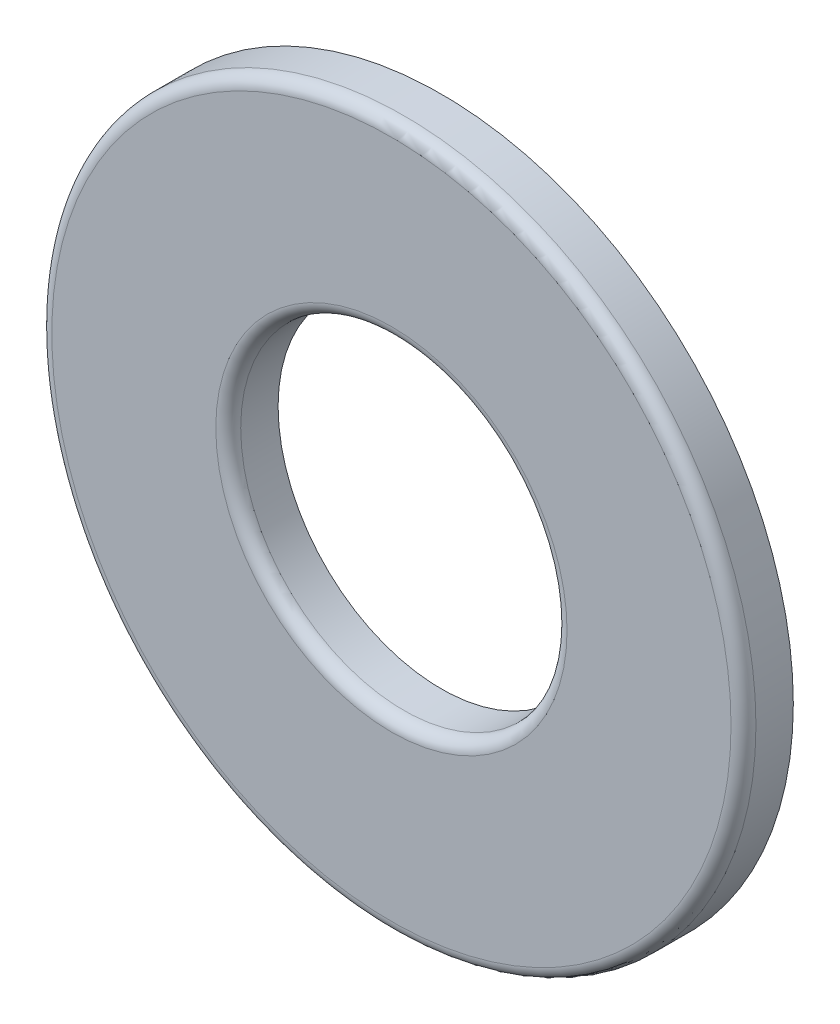
ISO-10303-21;
HEADER;
FILE_DESCRIPTION(('STEP AP214'),'2;1');
FILE_NAME('part.step','',(''),(''),'','','');
FILE_SCHEMA(('AUTOMOTIVE_DESIGN { 1 0 10303 214 1 1 1 1 }'));
ENDSEC;
DATA;
#1=APPLICATION_CONTEXT('core data for automotive mechanical design processes');
#2=APPLICATION_PROTOCOL_DEFINITION('international standard','automotive_design',2000,#1);
#3=PRODUCT_CONTEXT('',#1,'mechanical');
#4=PRODUCT('Part','Part','',(#3));
#5=PRODUCT_RELATED_PRODUCT_CATEGORY('part','',(#4));
#6=PRODUCT_DEFINITION_FORMATION('','',#4);
#7=PRODUCT_DEFINITION_CONTEXT('part definition',#1,'design');
#8=PRODUCT_DEFINITION('design','',#6,#7);
#9=PRODUCT_DEFINITION_SHAPE('','',#8);
#10=(LENGTH_UNIT() NAMED_UNIT(*) SI_UNIT(.MILLI.,.METRE.));
#11=(NAMED_UNIT(*) PLANE_ANGLE_UNIT() SI_UNIT($,.RADIAN.));
#12=(NAMED_UNIT(*) SI_UNIT($,.STERADIAN.) SOLID_ANGLE_UNIT());
#13=UNCERTAINTY_MEASURE_WITH_UNIT(LENGTH_MEASURE(1.E-05),#10,'distance_accuracy_value','');
#14=(GEOMETRIC_REPRESENTATION_CONTEXT(3) GLOBAL_UNCERTAINTY_ASSIGNED_CONTEXT((#13)) GLOBAL_UNIT_ASSIGNED_CONTEXT((#10,
#11,#12)) REPRESENTATION_CONTEXT('',''));
#15=CARTESIAN_POINT('',(0.,0.,0.));
#16=DIRECTION('',(0.,0.,1.));
#17=DIRECTION('',(1.,0.,0.));
#18=AXIS2_PLACEMENT_3D('',#15,#16,#17);
#19=CARTESIAN_POINT('',(0.,0.,0.393699999999996));
#20=DIRECTION('',(0.,0.,1.));
#21=DIRECTION('',(1.,0.,0.));
#22=AXIS2_PLACEMENT_3D('',#19,#20,#21);
#23=PLANE('',#22);
#24=CARTESIAN_POINT('',(0.,0.,0.393699999999996));
#25=DIRECTION('',(0.,0.,1.));
#26=DIRECTION('',(1.,0.,0.));
#27=AXIS2_PLACEMENT_3D('',#24,#25,#26);
#28=CIRCLE('',#27,5.36575);
#29=CARTESIAN_POINT('',(5.36575,0.,0.393699999999996));
#30=VERTEX_POINT('',#29);
#31=EDGE_CURVE('E46',#30,#30,#28,.T.);
#32=ORIENTED_EDGE('',*,*,#31,.T.);
#33=EDGE_LOOP('',(#32));
#34=FACE_BOUND('',#33,.T.);
#35=CARTESIAN_POINT('',(0.,0.,0.393699999999996));
#36=DIRECTION('',(0.,0.,1.));
#37=DIRECTION('',(1.,0.,0.));
#38=AXIS2_PLACEMENT_3D('',#35,#36,#37);
#39=CIRCLE('',#38,2.77495);
#40=CARTESIAN_POINT('',(2.77495,0.,0.393699999999996));
#41=VERTEX_POINT('',#40);
#42=EDGE_CURVE('E50',#41,#41,#39,.F.);
#43=ORIENTED_EDGE('',*,*,#42,.T.);
#44=EDGE_LOOP('',(#43));
#45=FACE_BOUND('',#44,.T.);
#46=ADVANCED_FACE('F35',(#34,#45),#23,.T.);
#47=CARTESIAN_POINT('',(0.,0.,0.393699999999996));
#48=DIRECTION('',(0.,0.,-1.));
#49=DIRECTION('',(-1.,0.,0.));
#50=AXIS2_PLACEMENT_3D('',#47,#48,#49);
#51=CYLINDRICAL_SURFACE('',#50,5.5626);
#52=CARTESIAN_POINT('',(0.,0.,0.196849999999996));
#53=DIRECTION('',(0.,0.,1.));
#54=DIRECTION('',(1.,0.,0.));
#55=AXIS2_PLACEMENT_3D('',#52,#53,#54);
#56=CIRCLE('',#55,5.5626);
#57=CARTESIAN_POINT('',(5.5626,0.,0.196849999999996));
#58=VERTEX_POINT('',#57);
#59=EDGE_CURVE('E42',#58,#58,#56,.F.);
#60=ORIENTED_EDGE('',*,*,#59,.T.);
#61=EDGE_LOOP('',(#60));
#62=FACE_BOUND('',#61,.T.);
#63=CARTESIAN_POINT('',(0.,0.,-0.393700000000004));
#64=DIRECTION('',(0.,0.,1.));
#65=DIRECTION('',(1.,0.,0.));
#66=AXIS2_PLACEMENT_3D('',#63,#64,#65);
#67=CIRCLE('',#66,5.5626);
#68=CARTESIAN_POINT('',(5.5626,0.,-0.393700000000004));
#69=VERTEX_POINT('',#68);
#70=EDGE_CURVE('E55',#69,#69,#67,.T.);
#71=ORIENTED_EDGE('',*,*,#70,.T.);
#72=EDGE_LOOP('',(#71));
#73=FACE_BOUND('',#72,.T.);
#74=ADVANCED_FACE('F67',(#62,#73),#51,.T.);
#75=CARTESIAN_POINT('',(0.,0.,0.393699999999996));
#76=DIRECTION('',(0.,0.,-1.));
#77=DIRECTION('',(-1.,0.,0.));
#78=AXIS2_PLACEMENT_3D('',#75,#76,#77);
#79=CYLINDRICAL_SURFACE('',#78,2.5781);
#80=CARTESIAN_POINT('',(0.,0.,0.196849999999996));
#81=DIRECTION('',(0.,0.,1.));
#82=DIRECTION('',(1.,0.,0.));
#83=AXIS2_PLACEMENT_3D('',#80,#81,#82);
#84=CIRCLE('',#83,2.5781);
#85=CARTESIAN_POINT('',(2.5781,0.,0.196849999999996));
#86=VERTEX_POINT('',#85);
#87=EDGE_CURVE('E10',#86,#86,#84,.T.);
#88=ORIENTED_EDGE('',*,*,#87,.T.);
#89=EDGE_LOOP('',(#88));
#90=FACE_BOUND('',#89,.T.);
#91=CARTESIAN_POINT('',(0.,0.,-0.393700000000004));
#92=DIRECTION('',(0.,0.,1.));
#93=DIRECTION('',(1.,0.,0.));
#94=AXIS2_PLACEMENT_3D('',#91,#92,#93);
#95=CIRCLE('',#94,2.5781);
#96=CARTESIAN_POINT('',(2.5781,0.,-0.393700000000004));
#97=VERTEX_POINT('',#96);
#98=EDGE_CURVE('E58',#97,#97,#95,.T.);
#99=ORIENTED_EDGE('',*,*,#98,.F.);
#100=EDGE_LOOP('',(#99));
#101=FACE_BOUND('',#100,.T.);
#102=ADVANCED_FACE('F65',(#90,#101),#79,.F.);
#103=CARTESIAN_POINT('',(0.,0.,-0.393700000000004));
#104=DIRECTION('',(0.,0.,1.));
#105=DIRECTION('',(1.,0.,0.));
#106=AXIS2_PLACEMENT_3D('',#103,#104,#105);
#107=PLANE('',#106);
#108=ORIENTED_EDGE('',*,*,#98,.T.);
#109=EDGE_LOOP('',(#108));
#110=FACE_BOUND('',#109,.T.);
#111=ORIENTED_EDGE('',*,*,#70,.F.);
#112=EDGE_LOOP('',(#111));
#113=FACE_BOUND('',#112,.T.);
#114=ADVANCED_FACE('F62',(#110,#113),#107,.F.);
#115=CARTESIAN_POINT('',(0.,0.,0.196849999999996));
#116=DIRECTION('',(0.,0.,1.));
#117=DIRECTION('',(1.,0.,0.));
#118=AXIS2_PLACEMENT_3D('',#115,#116,#117);
#119=TOROIDAL_SURFACE('',#118,5.36575,0.19685);
#120=ORIENTED_EDGE('',*,*,#59,.F.);
#121=EDGE_LOOP('',(#120));
#122=FACE_BOUND('',#121,.T.);
#123=ORIENTED_EDGE('',*,*,#31,.F.);
#124=EDGE_LOOP('',(#123));
#125=FACE_BOUND('',#124,.T.);
#126=ADVANCED_FACE('F73',(#122,#125),#119,.T.);
#127=CARTESIAN_POINT('',(0.,0.,0.196849999999996));
#128=DIRECTION('',(0.,0.,1.));
#129=DIRECTION('',(1.,0.,0.));
#130=AXIS2_PLACEMENT_3D('',#127,#128,#129);
#131=TOROIDAL_SURFACE('',#130,2.77495,0.19685);
#132=ORIENTED_EDGE('',*,*,#42,.F.);
#133=EDGE_LOOP('',(#132));
#134=FACE_BOUND('',#133,.T.);
#135=ORIENTED_EDGE('',*,*,#87,.F.);
#136=EDGE_LOOP('',(#135));
#137=FACE_BOUND('',#136,.T.);
#138=ADVANCED_FACE('F37',(#134,#137),#131,.T.);
#139=CLOSED_SHELL('',(#46,#74,#102,#114,#126,#138));
#140=MANIFOLD_SOLID_BREP('B2',#139);
#141=ADVANCED_BREP_SHAPE_REPRESENTATION('',(#18,#140),#14);
#142=SHAPE_DEFINITION_REPRESENTATION(#9,#141);
ENDSEC;
END-ISO-10303-21;
